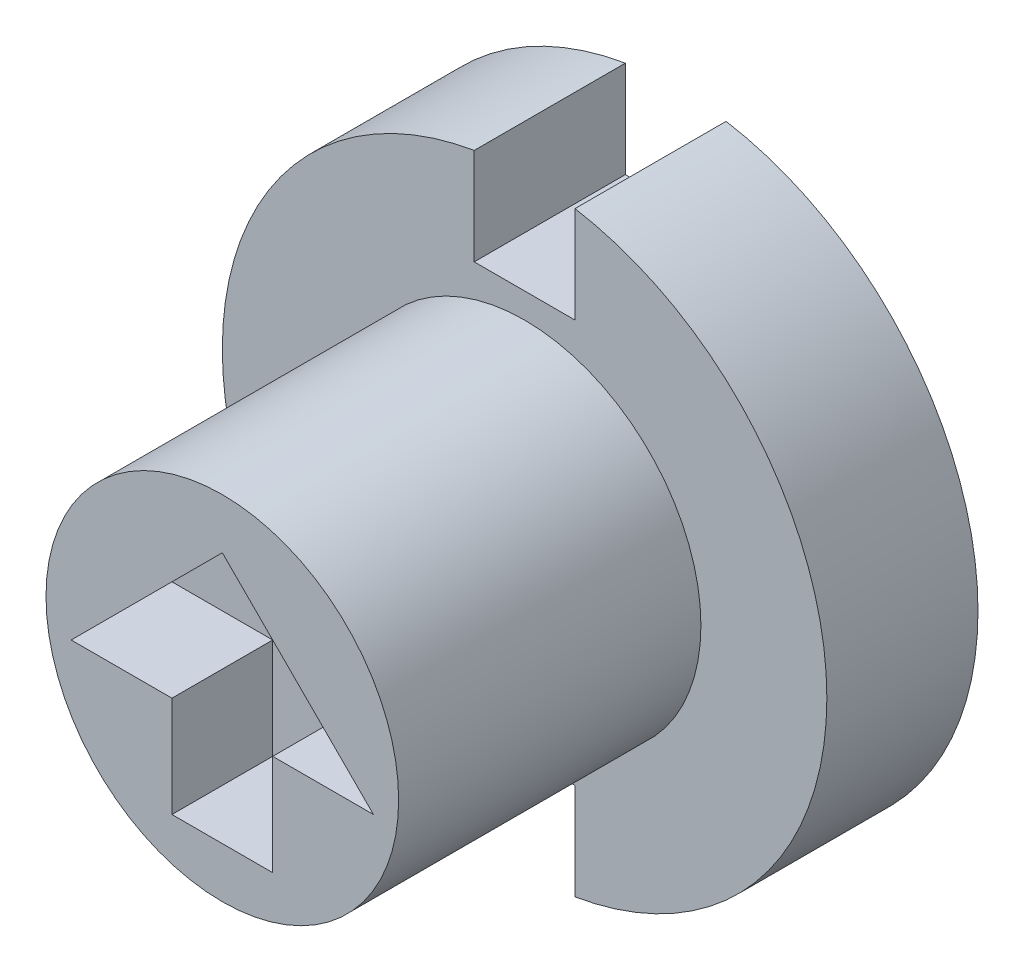
ISO-10303-21;
HEADER;
FILE_DESCRIPTION(('STEP AP214'),'2;1');
FILE_NAME('part.step','',(''),(''),'','','');
FILE_SCHEMA(('AUTOMOTIVE_DESIGN { 1 0 10303 214 1 1 1 1 }'));
ENDSEC;
DATA;
#1=APPLICATION_CONTEXT('core data for automotive mechanical design processes');
#2=APPLICATION_PROTOCOL_DEFINITION('international standard','automotive_design',2000,#1);
#3=PRODUCT_CONTEXT('',#1,'mechanical');
#4=PRODUCT('Part','Part','',(#3));
#5=PRODUCT_RELATED_PRODUCT_CATEGORY('part','',(#4));
#6=PRODUCT_DEFINITION_FORMATION('','',#4);
#7=PRODUCT_DEFINITION_CONTEXT('part definition',#1,'design');
#8=PRODUCT_DEFINITION('design','',#6,#7);
#9=PRODUCT_DEFINITION_SHAPE('','',#8);
#10=(LENGTH_UNIT() NAMED_UNIT(*) SI_UNIT(.MILLI.,.METRE.));
#11=(NAMED_UNIT(*) PLANE_ANGLE_UNIT() SI_UNIT($,.RADIAN.));
#12=(NAMED_UNIT(*) SI_UNIT($,.STERADIAN.) SOLID_ANGLE_UNIT());
#13=UNCERTAINTY_MEASURE_WITH_UNIT(LENGTH_MEASURE(1.E-05),#10,'distance_accuracy_value','');
#14=(GEOMETRIC_REPRESENTATION_CONTEXT(3) GLOBAL_UNCERTAINTY_ASSIGNED_CONTEXT((#13)) GLOBAL_UNIT_ASSIGNED_CONTEXT((#10,
#11,#12)) REPRESENTATION_CONTEXT('',''));
#15=CARTESIAN_POINT('',(0.,0.,0.));
#16=DIRECTION('',(0.,0.,1.));
#17=DIRECTION('',(1.,0.,0.));
#18=AXIS2_PLACEMENT_3D('',#15,#16,#17);
#19=CARTESIAN_POINT('',(-4.75410201159471,3.97833760996837,-3.));
#20=DIRECTION('',(0.,0.,1.));
#21=DIRECTION('',(1.,0.,0.));
#22=AXIS2_PLACEMENT_3D('',#19,#20,#21);
#23=CYLINDRICAL_SURFACE('',#22,6.);
#24=CARTESIAN_POINT('',(-4.75410201159471,3.97833760996837,0.));
#25=DIRECTION('',(0.,0.,-1.));
#26=DIRECTION('',(-1.,0.,0.));
#27=AXIS2_PLACEMENT_3D('',#24,#25,#26);
#28=CIRCLE('',#27,6.);
#29=CARTESIAN_POINT('',(-3.75410201159471,9.89441739306799,0.));
#30=VERTEX_POINT('',#29);
#31=CARTESIAN_POINT('',(-3.75410201159471,-1.93774217313124,0.));
#32=VERTEX_POINT('',#31);
#33=EDGE_CURVE('E255',#30,#32,#28,.T.);
#34=ORIENTED_EDGE('',*,*,#33,.T.);
#35=DIRECTION('',(0.,0.,1.));
#36=VECTOR('',#35,1.);
#37=CARTESIAN_POINT('',(-3.75410201159471,-1.93774217313124,-3.));
#38=LINE('',#37,#36);
#39=CARTESIAN_POINT('',(-3.75410201159471,-1.93774217313124,-3.));
#40=VERTEX_POINT('',#39);
#41=EDGE_CURVE('E48',#32,#40,#38,.F.);
#42=ORIENTED_EDGE('',*,*,#41,.T.);
#43=CARTESIAN_POINT('',(-4.75410201159471,3.97833760996837,-3.));
#44=DIRECTION('',(0.,0.,-1.));
#45=DIRECTION('',(-1.,0.,0.));
#46=AXIS2_PLACEMENT_3D('',#43,#44,#45);
#47=CIRCLE('',#46,6.);
#48=CARTESIAN_POINT('',(-3.75410201159471,9.89441739306799,-3.));
#49=VERTEX_POINT('',#48);
#50=EDGE_CURVE('E161',#49,#40,#47,.T.);
#51=ORIENTED_EDGE('',*,*,#50,.F.);
#52=DIRECTION('',(0.,0.,1.));
#53=VECTOR('',#52,1.);
#54=CARTESIAN_POINT('',(-3.75410201159471,9.89441739306799,-3.));
#55=LINE('',#54,#53);
#56=EDGE_CURVE('E193',#49,#30,#55,.T.);
#57=ORIENTED_EDGE('',*,*,#56,.T.);
#58=EDGE_LOOP('',(#34,#42,#51,#57));
#59=FACE_BOUND('',#58,.T.);
#60=ADVANCED_FACE('F33',(#59),#23,.T.);
#61=CARTESIAN_POINT('',(-4.75410201159471,3.97833760996837,6.));
#62=DIRECTION('',(0.,0.,-1.));
#63=DIRECTION('',(-1.,0.,0.));
#64=AXIS2_PLACEMENT_3D('',#61,#62,#63);
#65=CYLINDRICAL_SURFACE('',#64,3.5);
#66=CARTESIAN_POINT('',(-4.75410201159471,3.97833760996837,6.));
#67=DIRECTION('',(0.,0.,1.));
#68=DIRECTION('',(1.,0.,0.));
#69=AXIS2_PLACEMENT_3D('',#66,#67,#68);
#70=CIRCLE('',#69,3.5);
#71=CARTESIAN_POINT('',(-1.25410201159471,3.97833760996837,6.));
#72=VERTEX_POINT('',#71);
#73=EDGE_CURVE('E260',#72,#72,#70,.T.);
#74=ORIENTED_EDGE('',*,*,#73,.F.);
#75=EDGE_LOOP('',(#74));
#76=FACE_BOUND('',#75,.T.);
#77=CARTESIAN_POINT('',(-4.75410201159471,3.97833760996837,0.));
#78=DIRECTION('',(0.,0.,-1.));
#79=DIRECTION('',(-1.,0.,0.));
#80=AXIS2_PLACEMENT_3D('',#77,#78,#79);
#81=CIRCLE('',#80,3.5);
#82=CARTESIAN_POINT('',(-8.25410201159471,3.97833760996837,0.));
#83=VERTEX_POINT('',#82);
#84=EDGE_CURVE('E253',#83,#83,#81,.T.);
#85=ORIENTED_EDGE('',*,*,#84,.F.);
#86=EDGE_LOOP('',(#85));
#87=FACE_BOUND('',#86,.T.);
#88=ADVANCED_FACE('F35',(#76,#87),#65,.T.);
#89=CARTESIAN_POINT('',(-4.75410201159471,3.97833760996837,6.));
#90=DIRECTION('',(0.,0.,1.));
#91=DIRECTION('',(1.,0.,0.));
#92=AXIS2_PLACEMENT_3D('',#89,#90,#91);
#93=PLANE('',#92);
#94=DIRECTION('',(1.,0.,0.));
#95=VECTOR('',#94,1.);
#96=CARTESIAN_POINT('',(-5.75410201159471,3.47833760996837,6.));
#97=LINE('',#96,#95);
#98=CARTESIAN_POINT('',(-7.75410201159471,3.47833760996837,6.));
#99=VERTEX_POINT('',#98);
#100=CARTESIAN_POINT('',(-5.75410201159471,3.47833760996837,6.));
#101=VERTEX_POINT('',#100);
#102=EDGE_CURVE('E196',#99,#101,#97,.T.);
#103=ORIENTED_EDGE('',*,*,#102,.F.);
#104=DIRECTION('',(-0.707106781186547,-0.707106781186548,0.));
#105=VECTOR('',#104,1.);
#106=CARTESIAN_POINT('',(-7.75410201159471,3.47833760996837,6.));
#107=LINE('',#106,#105);
#108=CARTESIAN_POINT('',(-4.75410201159471,6.47833760996838,6.));
#109=VERTEX_POINT('',#108);
#110=EDGE_CURVE('E201',#109,#99,#107,.T.);
#111=ORIENTED_EDGE('',*,*,#110,.F.);
#112=DIRECTION('',(-0.707106781186548,0.707106781186547,0.));
#113=VECTOR('',#112,1.);
#114=CARTESIAN_POINT('',(-1.75410201159471,3.47833760996838,6.));
#115=LINE('',#114,#113);
#116=CARTESIAN_POINT('',(-1.75410201159471,3.47833760996838,6.));
#117=VERTEX_POINT('',#116);
#118=EDGE_CURVE('E233',#117,#109,#115,.T.);
#119=ORIENTED_EDGE('',*,*,#118,.F.);
#120=DIRECTION('',(1.,0.,0.));
#121=VECTOR('',#120,1.);
#122=CARTESIAN_POINT('',(-3.75410201159471,3.47833760996838,6.));
#123=LINE('',#122,#121);
#124=CARTESIAN_POINT('',(-3.75410201159471,3.47833760996838,6.));
#125=VERTEX_POINT('',#124);
#126=EDGE_CURVE('E230',#125,#117,#123,.T.);
#127=ORIENTED_EDGE('',*,*,#126,.F.);
#128=DIRECTION('',(0.,1.,0.));
#129=VECTOR('',#128,1.);
#130=CARTESIAN_POINT('',(-3.75410201159471,1.47833760996838,6.));
#131=LINE('',#130,#129);
#132=CARTESIAN_POINT('',(-3.75410201159471,1.47833760996838,6.));
#133=VERTEX_POINT('',#132);
#134=EDGE_CURVE('E227',#133,#125,#131,.T.);
#135=ORIENTED_EDGE('',*,*,#134,.F.);
#136=DIRECTION('',(1.,0.,0.));
#137=VECTOR('',#136,1.);
#138=CARTESIAN_POINT('',(-5.75410201159471,1.47833760996837,6.));
#139=LINE('',#138,#137);
#140=CARTESIAN_POINT('',(-5.75410201159471,1.47833760996837,6.));
#141=VERTEX_POINT('',#140);
#142=EDGE_CURVE('E224',#141,#133,#139,.T.);
#143=ORIENTED_EDGE('',*,*,#142,.F.);
#144=DIRECTION('',(0.,-1.,0.));
#145=VECTOR('',#144,1.);
#146=CARTESIAN_POINT('',(-5.75410201159471,1.47833760996837,6.));
#147=LINE('',#146,#145);
#148=EDGE_CURVE('E221',#101,#141,#147,.T.);
#149=ORIENTED_EDGE('',*,*,#148,.F.);
#150=EDGE_LOOP('',(#103,#111,#119,#127,#135,#143,#149));
#151=FACE_BOUND('',#150,.T.);
#152=ORIENTED_EDGE('',*,*,#73,.T.);
#153=EDGE_LOOP('',(#152));
#154=FACE_BOUND('',#153,.T.);
#155=ADVANCED_FACE('F301',(#151,#154),#93,.T.);
#156=CARTESIAN_POINT('',(-5.75410201159471,-1.93774217313124,-3.));
#157=VERTEX_POINT('',#156);
#158=CARTESIAN_POINT('',(-5.75410201159472,9.89441739306799,-3.));
#159=VERTEX_POINT('',#158);
#160=EDGE_CURVE('E254',#157,#159,#47,.T.);
#161=ORIENTED_EDGE('',*,*,#160,.F.);
#162=DIRECTION('',(0.,0.,1.));
#163=VECTOR('',#162,1.);
#164=CARTESIAN_POINT('',(-5.75410201159471,-1.93774217313124,-3.));
#165=LINE('',#164,#163);
#166=CARTESIAN_POINT('',(-5.75410201159471,-1.93774217313124,0.));
#167=VERTEX_POINT('',#166);
#168=EDGE_CURVE('E171',#157,#167,#165,.T.);
#169=ORIENTED_EDGE('',*,*,#168,.T.);
#170=CARTESIAN_POINT('',(-5.75410201159472,9.89441739306799,0.));
#171=VERTEX_POINT('',#170);
#172=EDGE_CURVE('E55',#167,#171,#28,.T.);
#173=ORIENTED_EDGE('',*,*,#172,.T.);
#174=DIRECTION('',(0.,0.,1.));
#175=VECTOR('',#174,1.);
#176=CARTESIAN_POINT('',(-5.75410201159472,9.89441739306799,-3.));
#177=LINE('',#176,#175);
#178=EDGE_CURVE('E189',#171,#159,#177,.F.);
#179=ORIENTED_EDGE('',*,*,#178,.T.);
#180=EDGE_LOOP('',(#161,#169,#173,#179));
#181=FACE_BOUND('',#180,.T.);
#182=ADVANCED_FACE('F276',(#181),#23,.T.);
#183=CARTESIAN_POINT('',(-4.75410201159471,3.97833760996837,-3.));
#184=DIRECTION('',(0.,0.,-1.));
#185=DIRECTION('',(-1.,0.,0.));
#186=AXIS2_PLACEMENT_3D('',#183,#184,#185);
#187=PLANE('',#186);
#188=DIRECTION('',(0.,-1.,0.));
#189=VECTOR('',#188,1.);
#190=CARTESIAN_POINT('',(-5.75410201159471,-0.0216623900316255,-3.));
#191=LINE('',#190,#189);
#192=CARTESIAN_POINT('',(-5.75410201159471,-0.0216623900316255,-3.));
#193=VERTEX_POINT('',#192);
#194=EDGE_CURVE('E148',#193,#157,#191,.T.);
#195=ORIENTED_EDGE('',*,*,#194,.T.);
#196=ORIENTED_EDGE('',*,*,#160,.T.);
#197=DIRECTION('',(0.,-1.,0.));
#198=VECTOR('',#197,1.);
#199=CARTESIAN_POINT('',(-5.75410201159471,7.97833760996837,-3.));
#200=LINE('',#199,#198);
#201=CARTESIAN_POINT('',(-5.75410201159471,7.97833760996837,-3.));
#202=VERTEX_POINT('',#201);
#203=EDGE_CURVE('E174',#159,#202,#200,.T.);
#204=ORIENTED_EDGE('',*,*,#203,.T.);
#205=DIRECTION('',(1.,0.,0.));
#206=VECTOR('',#205,1.);
#207=CARTESIAN_POINT('',(-5.75410201159471,7.97833760996837,-3.));
#208=LINE('',#207,#206);
#209=CARTESIAN_POINT('',(-3.75410201159471,7.97833760996837,-3.));
#210=VERTEX_POINT('',#209);
#211=EDGE_CURVE('E177',#202,#210,#208,.T.);
#212=ORIENTED_EDGE('',*,*,#211,.T.);
#213=DIRECTION('',(0.,1.,0.));
#214=VECTOR('',#213,1.);
#215=CARTESIAN_POINT('',(-3.75410201159471,7.97833760996837,-3.));
#216=LINE('',#215,#214);
#217=EDGE_CURVE('E181',#210,#49,#216,.T.);
#218=ORIENTED_EDGE('',*,*,#217,.T.);
#219=ORIENTED_EDGE('',*,*,#50,.T.);
#220=DIRECTION('',(0.,1.,0.));
#221=VECTOR('',#220,1.);
#222=CARTESIAN_POINT('',(-3.75410201159471,-0.0216623900316252,-3.));
#223=LINE('',#222,#221);
#224=CARTESIAN_POINT('',(-3.75410201159471,-0.0216623900316252,-3.));
#225=VERTEX_POINT('',#224);
#226=EDGE_CURVE('E143',#40,#225,#223,.T.);
#227=ORIENTED_EDGE('',*,*,#226,.T.);
#228=DIRECTION('',(-1.,0.,0.));
#229=VECTOR('',#228,1.);
#230=CARTESIAN_POINT('',(-5.75410201159471,-0.0216623900316255,-3.));
#231=LINE('',#230,#229);
#232=EDGE_CURVE('E151',#225,#193,#231,.T.);
#233=ORIENTED_EDGE('',*,*,#232,.T.);
#234=EDGE_LOOP('',(#195,#196,#204,#212,#218,#219,#227,#233));
#235=FACE_BOUND('',#234,.T.);
#236=ADVANCED_FACE('F158',(#235),#187,.T.);
#237=CARTESIAN_POINT('',(-4.75410201159471,3.97833760996837,0.));
#238=DIRECTION('',(0.,0.,-1.));
#239=DIRECTION('',(-1.,0.,0.));
#240=AXIS2_PLACEMENT_3D('',#237,#238,#239);
#241=PLANE('',#240);
#242=ORIENTED_EDGE('',*,*,#84,.T.);
#243=EDGE_LOOP('',(#242));
#244=FACE_BOUND('',#243,.T.);
#245=ORIENTED_EDGE('',*,*,#172,.F.);
#246=DIRECTION('',(0.,-1.,0.));
#247=VECTOR('',#246,1.);
#248=CARTESIAN_POINT('',(-5.75410201159471,-0.0216623900316255,0.));
#249=LINE('',#248,#247);
#250=CARTESIAN_POINT('',(-5.75410201159471,-0.0216623900316255,0.));
#251=VERTEX_POINT('',#250);
#252=EDGE_CURVE('E162',#251,#167,#249,.T.);
#253=ORIENTED_EDGE('',*,*,#252,.F.);
#254=DIRECTION('',(-1.,0.,0.));
#255=VECTOR('',#254,1.);
#256=CARTESIAN_POINT('',(-5.75410201159471,-0.0216623900316255,0.));
#257=LINE('',#256,#255);
#258=CARTESIAN_POINT('',(-3.75410201159471,-0.0216623900316252,0.));
#259=VERTEX_POINT('',#258);
#260=EDGE_CURVE('E164',#259,#251,#257,.T.);
#261=ORIENTED_EDGE('',*,*,#260,.F.);
#262=DIRECTION('',(0.,-1.,0.));
#263=VECTOR('',#262,1.);
#264=CARTESIAN_POINT('',(-3.75410201159471,3.97833760996837,0.));
#265=LINE('',#264,#263);
#266=EDGE_CURVE('E11',#259,#32,#265,.T.);
#267=ORIENTED_EDGE('',*,*,#266,.T.);
#268=ORIENTED_EDGE('',*,*,#33,.F.);
#269=DIRECTION('',(0.,1.,0.));
#270=VECTOR('',#269,1.);
#271=CARTESIAN_POINT('',(-3.75410201159471,7.97833760996837,0.));
#272=LINE('',#271,#270);
#273=CARTESIAN_POINT('',(-3.75410201159471,7.97833760996837,0.));
#274=VERTEX_POINT('',#273);
#275=EDGE_CURVE('E178',#274,#30,#272,.T.);
#276=ORIENTED_EDGE('',*,*,#275,.F.);
#277=DIRECTION('',(1.,0.,0.));
#278=VECTOR('',#277,1.);
#279=CARTESIAN_POINT('',(-5.75410201159471,7.97833760996837,0.));
#280=LINE('',#279,#278);
#281=CARTESIAN_POINT('',(-5.75410201159471,7.97833760996837,0.));
#282=VERTEX_POINT('',#281);
#283=EDGE_CURVE('E173',#282,#274,#280,.T.);
#284=ORIENTED_EDGE('',*,*,#283,.F.);
#285=DIRECTION('',(0.,1.,0.));
#286=VECTOR('',#285,1.);
#287=CARTESIAN_POINT('',(-5.75410201159471,3.97833760996837,0.));
#288=LINE('',#287,#286);
#289=EDGE_CURVE('E41',#282,#171,#288,.T.);
#290=ORIENTED_EDGE('',*,*,#289,.T.);
#291=EDGE_LOOP('',(#245,#253,#261,#267,#268,#276,#284,#290));
#292=FACE_BOUND('',#291,.T.);
#293=ADVANCED_FACE('F265',(#244,#292),#241,.F.);
#294=CARTESIAN_POINT('',(-5.75410201159471,3.47833760996837,4.));
#295=DIRECTION('',(0.,-1.,0.));
#296=DIRECTION('',(1.,0.,0.));
#297=AXIS2_PLACEMENT_3D('',#294,#295,#296);
#298=PLANE('',#297);
#299=ORIENTED_EDGE('',*,*,#102,.T.);
#300=DIRECTION('',(0.,0.,1.));
#301=VECTOR('',#300,1.);
#302=CARTESIAN_POINT('',(-5.75410201159471,3.47833760996837,4.));
#303=LINE('',#302,#301);
#304=CARTESIAN_POINT('',(-5.75410201159471,3.47833760996837,4.));
#305=VERTEX_POINT('',#304);
#306=EDGE_CURVE('E219',#305,#101,#303,.T.);
#307=ORIENTED_EDGE('',*,*,#306,.F.);
#308=DIRECTION('',(1.,0.,0.));
#309=VECTOR('',#308,1.);
#310=CARTESIAN_POINT('',(-5.75410201159471,3.47833760996837,4.));
#311=LINE('',#310,#309);
#312=CARTESIAN_POINT('',(-7.75410201159471,3.47833760996837,4.));
#313=VERTEX_POINT('',#312);
#314=EDGE_CURVE('E197',#313,#305,#311,.T.);
#315=ORIENTED_EDGE('',*,*,#314,.F.);
#316=DIRECTION('',(0.,0.,1.));
#317=VECTOR('',#316,1.);
#318=CARTESIAN_POINT('',(-7.75410201159471,3.47833760996837,4.));
#319=LINE('',#318,#317);
#320=EDGE_CURVE('E238',#313,#99,#319,.T.);
#321=ORIENTED_EDGE('',*,*,#320,.T.);
#322=EDGE_LOOP('',(#299,#307,#315,#321));
#323=FACE_BOUND('',#322,.T.);
#324=ADVANCED_FACE('F322',(#323),#298,.F.);
#325=CARTESIAN_POINT('',(-7.75410201159471,3.47833760996837,4.));
#326=DIRECTION('',(-0.707106781186548,0.707106781186547,0.));
#327=DIRECTION('',(-0.707106781186547,-0.707106781186548,0.));
#328=AXIS2_PLACEMENT_3D('',#325,#326,#327);
#329=PLANE('',#328);
#330=ORIENTED_EDGE('',*,*,#110,.T.);
#331=ORIENTED_EDGE('',*,*,#320,.F.);
#332=DIRECTION('',(-0.707106781186547,-0.707106781186548,0.));
#333=VECTOR('',#332,1.);
#334=CARTESIAN_POINT('',(-7.75410201159471,3.47833760996837,4.));
#335=LINE('',#334,#333);
#336=CARTESIAN_POINT('',(-4.75410201159471,6.47833760996838,4.));
#337=VERTEX_POINT('',#336);
#338=EDGE_CURVE('E216',#337,#313,#335,.T.);
#339=ORIENTED_EDGE('',*,*,#338,.F.);
#340=DIRECTION('',(0.,0.,1.));
#341=VECTOR('',#340,1.);
#342=CARTESIAN_POINT('',(-4.75410201159471,6.47833760996838,4.));
#343=LINE('',#342,#341);
#344=EDGE_CURVE('E240',#337,#109,#343,.T.);
#345=ORIENTED_EDGE('',*,*,#344,.T.);
#346=EDGE_LOOP('',(#330,#331,#339,#345));
#347=FACE_BOUND('',#346,.T.);
#348=ADVANCED_FACE('F326',(#347),#329,.F.);
#349=CARTESIAN_POINT('',(-1.75410201159471,3.47833760996838,4.));
#350=DIRECTION('',(0.707106781186547,0.707106781186548,0.));
#351=DIRECTION('',(-0.707106781186548,0.707106781186547,0.));
#352=AXIS2_PLACEMENT_3D('',#349,#350,#351);
#353=PLANE('',#352);
#354=ORIENTED_EDGE('',*,*,#118,.T.);
#355=ORIENTED_EDGE('',*,*,#344,.F.);
#356=DIRECTION('',(-0.707106781186548,0.707106781186547,0.));
#357=VECTOR('',#356,1.);
#358=CARTESIAN_POINT('',(-1.75410201159471,3.47833760996838,4.));
#359=LINE('',#358,#357);
#360=CARTESIAN_POINT('',(-1.75410201159471,3.47833760996838,4.));
#361=VERTEX_POINT('',#360);
#362=EDGE_CURVE('E213',#361,#337,#359,.T.);
#363=ORIENTED_EDGE('',*,*,#362,.F.);
#364=DIRECTION('',(0.,0.,1.));
#365=VECTOR('',#364,1.);
#366=CARTESIAN_POINT('',(-1.75410201159471,3.47833760996838,4.));
#367=LINE('',#366,#365);
#368=EDGE_CURVE('E242',#361,#117,#367,.T.);
#369=ORIENTED_EDGE('',*,*,#368,.T.);
#370=EDGE_LOOP('',(#354,#355,#363,#369));
#371=FACE_BOUND('',#370,.T.);
#372=ADVANCED_FACE('F344',(#371),#353,.F.);
#373=CARTESIAN_POINT('',(-3.75410201159471,3.47833760996838,4.));
#374=DIRECTION('',(0.,-1.,0.));
#375=DIRECTION('',(0.,0.,-1.));
#376=AXIS2_PLACEMENT_3D('',#373,#374,#375);
#377=PLANE('',#376);
#378=ORIENTED_EDGE('',*,*,#126,.T.);
#379=ORIENTED_EDGE('',*,*,#368,.F.);
#380=DIRECTION('',(1.,0.,0.));
#381=VECTOR('',#380,1.);
#382=CARTESIAN_POINT('',(-3.75410201159471,3.47833760996838,4.));
#383=LINE('',#382,#381);
#384=CARTESIAN_POINT('',(-3.75410201159471,3.47833760996838,4.));
#385=VERTEX_POINT('',#384);
#386=EDGE_CURVE('E210',#385,#361,#383,.T.);
#387=ORIENTED_EDGE('',*,*,#386,.F.);
#388=DIRECTION('',(0.,0.,1.));
#389=VECTOR('',#388,1.);
#390=CARTESIAN_POINT('',(-3.75410201159471,3.47833760996838,4.));
#391=LINE('',#390,#389);
#392=EDGE_CURVE('E244',#385,#125,#391,.T.);
#393=ORIENTED_EDGE('',*,*,#392,.T.);
#394=EDGE_LOOP('',(#378,#379,#387,#393));
#395=FACE_BOUND('',#394,.T.);
#396=ADVANCED_FACE('F340',(#395),#377,.F.);
#397=CARTESIAN_POINT('',(-3.75410201159471,1.47833760996838,4.));
#398=DIRECTION('',(1.,0.,0.));
#399=DIRECTION('',(0.,0.,-1.));
#400=AXIS2_PLACEMENT_3D('',#397,#398,#399);
#401=PLANE('',#400);
#402=ORIENTED_EDGE('',*,*,#134,.T.);
#403=ORIENTED_EDGE('',*,*,#392,.F.);
#404=DIRECTION('',(0.,1.,0.));
#405=VECTOR('',#404,1.);
#406=CARTESIAN_POINT('',(-3.75410201159471,1.47833760996838,4.));
#407=LINE('',#406,#405);
#408=CARTESIAN_POINT('',(-3.75410201159471,1.47833760996838,4.));
#409=VERTEX_POINT('',#408);
#410=EDGE_CURVE('E207',#409,#385,#407,.T.);
#411=ORIENTED_EDGE('',*,*,#410,.F.);
#412=DIRECTION('',(0.,0.,1.));
#413=VECTOR('',#412,1.);
#414=CARTESIAN_POINT('',(-3.75410201159471,1.47833760996838,4.));
#415=LINE('',#414,#413);
#416=EDGE_CURVE('E246',#409,#133,#415,.T.);
#417=ORIENTED_EDGE('',*,*,#416,.T.);
#418=EDGE_LOOP('',(#402,#403,#411,#417));
#419=FACE_BOUND('',#418,.T.);
#420=ADVANCED_FACE('F336',(#419),#401,.F.);
#421=CARTESIAN_POINT('',(-5.75410201159471,1.47833760996837,4.));
#422=DIRECTION('',(0.,-1.,0.));
#423=DIRECTION('',(1.,0.,0.));
#424=AXIS2_PLACEMENT_3D('',#421,#422,#423);
#425=PLANE('',#424);
#426=ORIENTED_EDGE('',*,*,#142,.T.);
#427=ORIENTED_EDGE('',*,*,#416,.F.);
#428=DIRECTION('',(1.,0.,0.));
#429=VECTOR('',#428,1.);
#430=CARTESIAN_POINT('',(-5.75410201159471,1.47833760996837,4.));
#431=LINE('',#430,#429);
#432=CARTESIAN_POINT('',(-5.75410201159471,1.47833760996837,4.));
#433=VERTEX_POINT('',#432);
#434=EDGE_CURVE('E204',#433,#409,#431,.T.);
#435=ORIENTED_EDGE('',*,*,#434,.F.);
#436=DIRECTION('',(0.,0.,1.));
#437=VECTOR('',#436,1.);
#438=CARTESIAN_POINT('',(-5.75410201159471,1.47833760996837,4.));
#439=LINE('',#438,#437);
#440=EDGE_CURVE('E248',#433,#141,#439,.T.);
#441=ORIENTED_EDGE('',*,*,#440,.T.);
#442=EDGE_LOOP('',(#426,#427,#435,#441));
#443=FACE_BOUND('',#442,.T.);
#444=ADVANCED_FACE('F332',(#443),#425,.F.);
#445=CARTESIAN_POINT('',(-5.75410201159471,1.47833760996837,4.));
#446=DIRECTION('',(-1.,0.,0.));
#447=DIRECTION('',(0.,-1.,0.));
#448=AXIS2_PLACEMENT_3D('',#445,#446,#447);
#449=PLANE('',#448);
#450=ORIENTED_EDGE('',*,*,#148,.T.);
#451=ORIENTED_EDGE('',*,*,#440,.F.);
#452=DIRECTION('',(0.,-1.,0.));
#453=VECTOR('',#452,1.);
#454=CARTESIAN_POINT('',(-5.75410201159471,1.47833760996837,4.));
#455=LINE('',#454,#453);
#456=EDGE_CURVE('E200',#305,#433,#455,.T.);
#457=ORIENTED_EDGE('',*,*,#456,.F.);
#458=ORIENTED_EDGE('',*,*,#306,.T.);
#459=EDGE_LOOP('',(#450,#451,#457,#458));
#460=FACE_BOUND('',#459,.T.);
#461=ADVANCED_FACE('F291',(#460),#449,.F.);
#462=CARTESIAN_POINT('',(0.,0.,4.));
#463=DIRECTION('',(0.,0.,-1.));
#464=DIRECTION('',(-1.,0.,0.));
#465=AXIS2_PLACEMENT_3D('',#462,#463,#464);
#466=PLANE('',#465);
#467=ORIENTED_EDGE('',*,*,#314,.T.);
#468=ORIENTED_EDGE('',*,*,#456,.T.);
#469=ORIENTED_EDGE('',*,*,#434,.T.);
#470=ORIENTED_EDGE('',*,*,#410,.T.);
#471=ORIENTED_EDGE('',*,*,#386,.T.);
#472=ORIENTED_EDGE('',*,*,#362,.T.);
#473=ORIENTED_EDGE('',*,*,#338,.T.);
#474=EDGE_LOOP('',(#467,#468,#469,#470,#471,#472,#473));
#475=FACE_BOUND('',#474,.T.);
#476=ADVANCED_FACE('F284',(#475),#466,.F.);
#477=CARTESIAN_POINT('',(-3.75410201159471,7.97833760996837,-3.));
#478=DIRECTION('',(1.,0.,0.));
#479=DIRECTION('',(0.,1.,0.));
#480=AXIS2_PLACEMENT_3D('',#477,#478,#479);
#481=PLANE('',#480);
#482=ORIENTED_EDGE('',*,*,#217,.F.);
#483=DIRECTION('',(0.,0.,1.));
#484=VECTOR('',#483,1.);
#485=CARTESIAN_POINT('',(-3.75410201159471,7.97833760996837,-3.));
#486=LINE('',#485,#484);
#487=EDGE_CURVE('E187',#210,#274,#486,.T.);
#488=ORIENTED_EDGE('',*,*,#487,.T.);
#489=ORIENTED_EDGE('',*,*,#275,.T.);
#490=ORIENTED_EDGE('',*,*,#56,.F.);
#491=EDGE_LOOP('',(#482,#488,#489,#490));
#492=FACE_BOUND('',#491,.T.);
#493=ADVANCED_FACE('F282',(#492),#481,.F.);
#494=CARTESIAN_POINT('',(-5.75410201159471,7.97833760996837,-3.));
#495=DIRECTION('',(-1.,0.,0.));
#496=DIRECTION('',(0.,-1.,0.));
#497=AXIS2_PLACEMENT_3D('',#494,#495,#496);
#498=PLANE('',#497);
#499=ORIENTED_EDGE('',*,*,#289,.F.);
#500=DIRECTION('',(0.,0.,1.));
#501=VECTOR('',#500,1.);
#502=CARTESIAN_POINT('',(-5.75410201159471,7.97833760996837,-3.));
#503=LINE('',#502,#501);
#504=EDGE_CURVE('E183',#202,#282,#503,.T.);
#505=ORIENTED_EDGE('',*,*,#504,.F.);
#506=ORIENTED_EDGE('',*,*,#203,.F.);
#507=ORIENTED_EDGE('',*,*,#178,.F.);
#508=EDGE_LOOP('',(#499,#505,#506,#507));
#509=FACE_BOUND('',#508,.T.);
#510=ADVANCED_FACE('F269',(#509),#498,.F.);
#511=CARTESIAN_POINT('',(-5.75410201159471,7.97833760996837,-3.));
#512=DIRECTION('',(0.,-1.,0.));
#513=DIRECTION('',(0.,0.,-1.));
#514=AXIS2_PLACEMENT_3D('',#511,#512,#513);
#515=PLANE('',#514);
#516=ORIENTED_EDGE('',*,*,#283,.T.);
#517=ORIENTED_EDGE('',*,*,#487,.F.);
#518=ORIENTED_EDGE('',*,*,#211,.F.);
#519=ORIENTED_EDGE('',*,*,#504,.T.);
#520=EDGE_LOOP('',(#516,#517,#518,#519));
#521=FACE_BOUND('',#520,.T.);
#522=ADVANCED_FACE('F273',(#521),#515,.F.);
#523=CARTESIAN_POINT('',(-5.75410201159471,-0.0216623900316255,-3.));
#524=DIRECTION('',(-1.,0.,0.));
#525=DIRECTION('',(0.,-1.,0.));
#526=AXIS2_PLACEMENT_3D('',#523,#524,#525);
#527=PLANE('',#526);
#528=ORIENTED_EDGE('',*,*,#194,.F.);
#529=DIRECTION('',(0.,0.,1.));
#530=VECTOR('',#529,1.);
#531=CARTESIAN_POINT('',(-5.75410201159471,-0.0216623900316255,-3.));
#532=LINE('',#531,#530);
#533=EDGE_CURVE('E147',#193,#251,#532,.T.);
#534=ORIENTED_EDGE('',*,*,#533,.T.);
#535=ORIENTED_EDGE('',*,*,#252,.T.);
#536=ORIENTED_EDGE('',*,*,#168,.F.);
#537=EDGE_LOOP('',(#528,#534,#535,#536));
#538=FACE_BOUND('',#537,.T.);
#539=ADVANCED_FACE('F278',(#538),#527,.F.);
#540=CARTESIAN_POINT('',(-3.75410201159471,-0.0216623900316252,-3.));
#541=DIRECTION('',(1.,0.,0.));
#542=DIRECTION('',(0.,1.,0.));
#543=AXIS2_PLACEMENT_3D('',#540,#541,#542);
#544=PLANE('',#543);
#545=ORIENTED_EDGE('',*,*,#266,.F.);
#546=DIRECTION('',(0.,0.,1.));
#547=VECTOR('',#546,1.);
#548=CARTESIAN_POINT('',(-3.75410201159471,-0.0216623900316252,-3.));
#549=LINE('',#548,#547);
#550=EDGE_CURVE('E139',#225,#259,#549,.T.);
#551=ORIENTED_EDGE('',*,*,#550,.F.);
#552=ORIENTED_EDGE('',*,*,#226,.F.);
#553=ORIENTED_EDGE('',*,*,#41,.F.);
#554=EDGE_LOOP('',(#545,#551,#552,#553));
#555=FACE_BOUND('',#554,.T.);
#556=ADVANCED_FACE('F141',(#555),#544,.F.);
#557=CARTESIAN_POINT('',(-5.75410201159471,-0.0216623900316255,-3.));
#558=DIRECTION('',(0.,1.,0.));
#559=DIRECTION('',(-1.,0.,0.));
#560=AXIS2_PLACEMENT_3D('',#557,#558,#559);
#561=PLANE('',#560);
#562=ORIENTED_EDGE('',*,*,#260,.T.);
#563=ORIENTED_EDGE('',*,*,#533,.F.);
#564=ORIENTED_EDGE('',*,*,#232,.F.);
#565=ORIENTED_EDGE('',*,*,#550,.T.);
#566=EDGE_LOOP('',(#562,#563,#564,#565));
#567=FACE_BOUND('',#566,.T.);
#568=ADVANCED_FACE('F152',(#567),#561,.F.);
#569=CLOSED_SHELL('',(#60,#88,#155,#182,#236,#293,#324,#348,#372,#396,#420,#444,#461,#476,#493,
#510,#522,#539,#556,#568));
#570=MANIFOLD_SOLID_BREP('B2',#569);
#571=ADVANCED_BREP_SHAPE_REPRESENTATION('',(#18,#570),#14);
#572=SHAPE_DEFINITION_REPRESENTATION(#9,#571);
ENDSEC;
END-ISO-10303-21;
